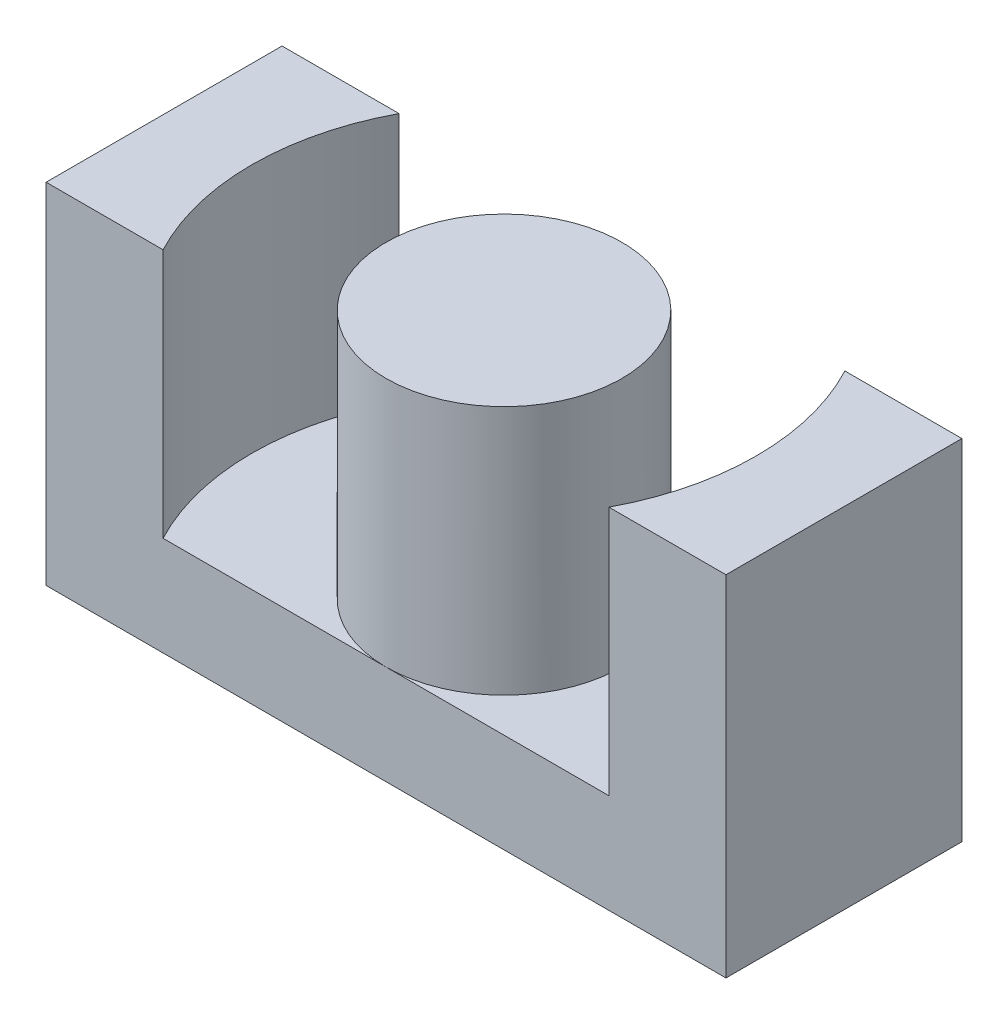
ISO-10303-21;
HEADER;
FILE_DESCRIPTION(('STEP AP214'),'2;1');
FILE_NAME('part.step','',(''),(''),'','','');
FILE_SCHEMA(('AUTOMOTIVE_DESIGN { 1 0 10303 214 1 1 1 1 }'));
ENDSEC;
DATA;
#1=APPLICATION_CONTEXT('core data for automotive mechanical design processes');
#2=APPLICATION_PROTOCOL_DEFINITION('international standard','automotive_design',2000,#1);
#3=PRODUCT_CONTEXT('',#1,'mechanical');
#4=PRODUCT('Part','Part','',(#3));
#5=PRODUCT_RELATED_PRODUCT_CATEGORY('part','',(#4));
#6=PRODUCT_DEFINITION_FORMATION('','',#4);
#7=PRODUCT_DEFINITION_CONTEXT('part definition',#1,'design');
#8=PRODUCT_DEFINITION('design','',#6,#7);
#9=PRODUCT_DEFINITION_SHAPE('','',#8);
#10=(LENGTH_UNIT() NAMED_UNIT(*) SI_UNIT(.MILLI.,.METRE.));
#11=(NAMED_UNIT(*) PLANE_ANGLE_UNIT() SI_UNIT($,.RADIAN.));
#12=(NAMED_UNIT(*) SI_UNIT($,.STERADIAN.) SOLID_ANGLE_UNIT());
#13=UNCERTAINTY_MEASURE_WITH_UNIT(LENGTH_MEASURE(1.E-05),#10,'distance_accuracy_value','');
#14=(GEOMETRIC_REPRESENTATION_CONTEXT(3) GLOBAL_UNCERTAINTY_ASSIGNED_CONTEXT((#13)) GLOBAL_UNIT_ASSIGNED_CONTEXT((#10,
#11,#12)) REPRESENTATION_CONTEXT('',''));
#15=CARTESIAN_POINT('',(0.,0.,0.));
#16=DIRECTION('',(0.,0.,1.));
#17=DIRECTION('',(1.,0.,0.));
#18=AXIS2_PLACEMENT_3D('',#15,#16,#17);
#19=CARTESIAN_POINT('',(0.,0.,22.4));
#20=DIRECTION('',(0.,1.,0.));
#21=DIRECTION('',(0.,0.,1.));
#22=AXIS2_PLACEMENT_3D('',#19,#20,#21);
#23=PLANE('',#22);
#24=CARTESIAN_POINT('',(0.,0.,22.4));
#25=DIRECTION('',(0.,1.,0.));
#26=DIRECTION('',(0.,0.,1.));
#27=AXIS2_PLACEMENT_3D('',#24,#25,#26);
#28=CIRCLE('',#27,7.6);
#29=CARTESIAN_POINT('',(0.,0.,30.));
#30=VERTEX_POINT('',#29);
#31=EDGE_CURVE('E20',#30,#30,#28,.F.);
#32=ORIENTED_EDGE('',*,*,#31,.F.);
#33=EDGE_LOOP('',(#32));
#34=FACE_BOUND('',#33,.T.);
#35=ADVANCED_FACE('F17',(#34),#23,.T.);
#36=CARTESIAN_POINT('',(0.,-0.1,22.4));
#37=DIRECTION('',(0.,1.,0.));
#38=DIRECTION('',(0.,0.,1.));
#39=AXIS2_PLACEMENT_3D('',#36,#37,#38);
#40=CYLINDRICAL_SURFACE('',#39,7.6);
#41=ORIENTED_EDGE('',*,*,#31,.T.);
#42=EDGE_LOOP('',(#41));
#43=FACE_BOUND('',#42,.T.);
#44=CARTESIAN_POINT('',(0.,-16.1,22.4));
#45=DIRECTION('',(0.,1.,0.));
#46=DIRECTION('',(0.,0.,1.));
#47=AXIS2_PLACEMENT_3D('',#44,#45,#46);
#48=CIRCLE('',#47,7.6);
#49=CARTESIAN_POINT('',(0.,-16.1,30.));
#50=VERTEX_POINT('',#49);
#51=CARTESIAN_POINT('',(0.,-16.1,14.8));
#52=VERTEX_POINT('',#51);
#53=EDGE_CURVE('E167',#50,#52,#48,.T.);
#54=ORIENTED_EDGE('',*,*,#53,.T.);
#55=CARTESIAN_POINT('',(0.,-16.1,22.4));
#56=DIRECTION('',(0.,1.,0.));
#57=DIRECTION('',(0.,0.,1.));
#58=AXIS2_PLACEMENT_3D('',#55,#56,#57);
#59=CIRCLE('',#58,7.6);
#60=EDGE_CURVE('E106',#52,#50,#59,.T.);
#61=ORIENTED_EDGE('',*,*,#60,.T.);
#62=EDGE_LOOP('',(#54,#61));
#63=FACE_BOUND('',#62,.T.);
#64=ADVANCED_FACE('F173',(#43,#63),#40,.T.);
#65=CARTESIAN_POINT('',(0.,0.,22.4));
#66=DIRECTION('',(0.,1.,0.));
#67=DIRECTION('',(0.,0.,1.));
#68=AXIS2_PLACEMENT_3D('',#65,#66,#67);
#69=PLANE('',#68);
#70=CARTESIAN_POINT('',(0.,0.,22.4));
#71=DIRECTION('',(0.,1.,0.));
#72=DIRECTION('',(0.,0.,1.));
#73=AXIS2_PLACEMENT_3D('',#70,#71,#72);
#74=CIRCLE('',#73,16.25);
#75=CARTESIAN_POINT('',(-14.3632343154309,0.,30.));
#76=VERTEX_POINT('',#75);
#77=CARTESIAN_POINT('',(-14.3632343154309,0.,14.8));
#78=VERTEX_POINT('',#77);
#79=EDGE_CURVE('E89',#76,#78,#74,.F.);
#80=ORIENTED_EDGE('',*,*,#79,.T.);
#81=DIRECTION('',(1.,0.,0.));
#82=VECTOR('',#81,1.);
#83=CARTESIAN_POINT('',(-21.9,0.,14.8));
#84=LINE('',#83,#82);
#85=CARTESIAN_POINT('',(-21.9,0.,14.8));
#86=VERTEX_POINT('',#85);
#87=EDGE_CURVE('E147',#78,#86,#84,.F.);
#88=ORIENTED_EDGE('',*,*,#87,.T.);
#89=DIRECTION('',(0.,0.,-1.));
#90=VECTOR('',#89,1.);
#91=CARTESIAN_POINT('',(-21.9,0.,30.));
#92=LINE('',#91,#90);
#93=CARTESIAN_POINT('',(-21.9,0.,30.));
#94=VERTEX_POINT('',#93);
#95=EDGE_CURVE('E92',#86,#94,#92,.F.);
#96=ORIENTED_EDGE('',*,*,#95,.T.);
#97=DIRECTION('',(1.,0.,0.));
#98=VECTOR('',#97,1.);
#99=CARTESIAN_POINT('',(-21.9,0.,30.));
#100=LINE('',#99,#98);
#101=EDGE_CURVE('E86',#94,#76,#100,.T.);
#102=ORIENTED_EDGE('',*,*,#101,.T.);
#103=EDGE_LOOP('',(#80,#88,#96,#102));
#104=FACE_BOUND('',#103,.T.);
#105=ADVANCED_FACE('F88',(#104),#69,.T.);
#106=CARTESIAN_POINT('',(0.,0.,22.4));
#107=DIRECTION('',(0.,1.,0.));
#108=DIRECTION('',(0.,0.,1.));
#109=AXIS2_PLACEMENT_3D('',#106,#107,#108);
#110=CYLINDRICAL_SURFACE('',#109,16.25);
#111=ORIENTED_EDGE('',*,*,#79,.F.);
#112=DIRECTION('',(0.,1.,0.));
#113=VECTOR('',#112,1.);
#114=CARTESIAN_POINT('',(-14.36323431543,-16.1,30.));
#115=LINE('',#114,#113);
#116=CARTESIAN_POINT('',(-14.3632343154309,-16.1,30.));
#117=VERTEX_POINT('',#116);
#118=EDGE_CURVE('E97',#76,#117,#115,.F.);
#119=ORIENTED_EDGE('',*,*,#118,.T.);
#120=CARTESIAN_POINT('',(0.,-16.1,22.4));
#121=DIRECTION('',(0.,1.,0.));
#122=DIRECTION('',(0.,0.,1.));
#123=AXIS2_PLACEMENT_3D('',#120,#121,#122);
#124=CIRCLE('',#123,16.25);
#125=CARTESIAN_POINT('',(-14.3632343154309,-16.1,14.8));
#126=VERTEX_POINT('',#125);
#127=EDGE_CURVE('E169',#117,#126,#124,.F.);
#128=ORIENTED_EDGE('',*,*,#127,.T.);
#129=DIRECTION('',(0.,-1.,0.));
#130=VECTOR('',#129,1.);
#131=CARTESIAN_POINT('',(-14.36323431543,-16.1,14.8));
#132=LINE('',#131,#130);
#133=EDGE_CURVE('E104',#126,#78,#132,.F.);
#134=ORIENTED_EDGE('',*,*,#133,.T.);
#135=EDGE_LOOP('',(#111,#119,#128,#134));
#136=FACE_BOUND('',#135,.T.);
#137=ADVANCED_FACE('F101',(#136),#110,.F.);
#138=CARTESIAN_POINT('',(21.9,-16.1,14.8));
#139=DIRECTION('',(0.,-1.,0.));
#140=DIRECTION('',(0.,0.,-1.));
#141=AXIS2_PLACEMENT_3D('',#138,#139,#140);
#142=PLANE('',#141);
#143=ORIENTED_EDGE('',*,*,#127,.F.);
#144=DIRECTION('',(1.,0.,0.));
#145=VECTOR('',#144,1.);
#146=CARTESIAN_POINT('',(-21.9,-16.1,30.));
#147=LINE('',#146,#145);
#148=EDGE_CURVE('E112',#117,#50,#147,.T.);
#149=ORIENTED_EDGE('',*,*,#148,.T.);
#150=ORIENTED_EDGE('',*,*,#60,.F.);
#151=DIRECTION('',(1.,0.,0.));
#152=VECTOR('',#151,1.);
#153=CARTESIAN_POINT('',(-21.9,-16.1,14.8));
#154=LINE('',#153,#152);
#155=EDGE_CURVE('E148',#52,#126,#154,.F.);
#156=ORIENTED_EDGE('',*,*,#155,.T.);
#157=EDGE_LOOP('',(#143,#149,#150,#156));
#158=FACE_BOUND('',#157,.T.);
#159=ADVANCED_FACE('F177',(#158),#142,.F.);
#160=CARTESIAN_POINT('',(21.9,-16.1,14.8));
#161=DIRECTION('',(0.,-1.,0.));
#162=DIRECTION('',(0.,0.,-1.));
#163=AXIS2_PLACEMENT_3D('',#160,#161,#162);
#164=PLANE('',#163);
#165=CARTESIAN_POINT('',(0.,-16.1,22.4));
#166=DIRECTION('',(0.,1.,0.));
#167=DIRECTION('',(0.,0.,1.));
#168=AXIS2_PLACEMENT_3D('',#165,#166,#167);
#169=CIRCLE('',#168,16.25);
#170=CARTESIAN_POINT('',(14.3632343154319,-16.1,30.));
#171=VERTEX_POINT('',#170);
#172=CARTESIAN_POINT('',(14.3632343154319,-16.1,14.8));
#173=VERTEX_POINT('',#172);
#174=EDGE_CURVE('E165',#171,#173,#169,.T.);
#175=ORIENTED_EDGE('',*,*,#174,.T.);
#176=DIRECTION('',(1.,0.,0.));
#177=VECTOR('',#176,1.);
#178=CARTESIAN_POINT('',(-21.9,-16.1,14.8));
#179=LINE('',#178,#177);
#180=EDGE_CURVE('E158',#173,#52,#179,.F.);
#181=ORIENTED_EDGE('',*,*,#180,.T.);
#182=ORIENTED_EDGE('',*,*,#53,.F.);
#183=DIRECTION('',(1.,0.,0.));
#184=VECTOR('',#183,1.);
#185=CARTESIAN_POINT('',(-21.9,-16.1,30.));
#186=LINE('',#185,#184);
#187=EDGE_CURVE('E114',#50,#171,#186,.T.);
#188=ORIENTED_EDGE('',*,*,#187,.T.);
#189=EDGE_LOOP('',(#175,#181,#182,#188));
#190=FACE_BOUND('',#189,.T.);
#191=ADVANCED_FACE('F179',(#190),#164,.F.);
#192=CARTESIAN_POINT('',(0.,0.,22.4));
#193=DIRECTION('',(0.,1.,0.));
#194=DIRECTION('',(0.,0.,1.));
#195=AXIS2_PLACEMENT_3D('',#192,#193,#194);
#196=CYLINDRICAL_SURFACE('',#195,16.25);
#197=CARTESIAN_POINT('',(0.,0.,22.4));
#198=DIRECTION('',(0.,1.,0.));
#199=DIRECTION('',(0.,0.,1.));
#200=AXIS2_PLACEMENT_3D('',#197,#198,#199);
#201=CIRCLE('',#200,16.25);
#202=CARTESIAN_POINT('',(14.3632343154319,0.,14.8));
#203=VERTEX_POINT('',#202);
#204=CARTESIAN_POINT('',(14.3632343154319,0.,30.));
#205=VERTEX_POINT('',#204);
#206=EDGE_CURVE('E126',#203,#205,#201,.F.);
#207=ORIENTED_EDGE('',*,*,#206,.F.);
#208=DIRECTION('',(0.,-1.,0.));
#209=VECTOR('',#208,1.);
#210=CARTESIAN_POINT('',(14.363234315432,-16.1,14.8));
#211=LINE('',#210,#209);
#212=EDGE_CURVE('E139',#203,#173,#211,.T.);
#213=ORIENTED_EDGE('',*,*,#212,.T.);
#214=ORIENTED_EDGE('',*,*,#174,.F.);
#215=DIRECTION('',(0.,1.,0.));
#216=VECTOR('',#215,1.);
#217=CARTESIAN_POINT('',(14.363234315432,-16.1,30.));
#218=LINE('',#217,#216);
#219=EDGE_CURVE('E183',#171,#205,#218,.T.);
#220=ORIENTED_EDGE('',*,*,#219,.T.);
#221=EDGE_LOOP('',(#207,#213,#214,#220));
#222=FACE_BOUND('',#221,.T.);
#223=ADVANCED_FACE('F221',(#222),#196,.F.);
#224=CARTESIAN_POINT('',(0.,0.,22.4));
#225=DIRECTION('',(0.,1.,0.));
#226=DIRECTION('',(0.,0.,1.));
#227=AXIS2_PLACEMENT_3D('',#224,#225,#226);
#228=PLANE('',#227);
#229=ORIENTED_EDGE('',*,*,#206,.T.);
#230=DIRECTION('',(1.,0.,0.));
#231=VECTOR('',#230,1.);
#232=CARTESIAN_POINT('',(-21.9,0.,30.));
#233=LINE('',#232,#231);
#234=CARTESIAN_POINT('',(21.9,0.,30.));
#235=VERTEX_POINT('',#234);
#236=EDGE_CURVE('E184',#205,#235,#233,.T.);
#237=ORIENTED_EDGE('',*,*,#236,.T.);
#238=DIRECTION('',(0.,0.,1.));
#239=VECTOR('',#238,1.);
#240=CARTESIAN_POINT('',(21.9,0.,30.));
#241=LINE('',#240,#239);
#242=CARTESIAN_POINT('',(21.9,0.,14.8));
#243=VERTEX_POINT('',#242);
#244=EDGE_CURVE('E143',#235,#243,#241,.F.);
#245=ORIENTED_EDGE('',*,*,#244,.T.);
#246=DIRECTION('',(1.,0.,0.));
#247=VECTOR('',#246,1.);
#248=CARTESIAN_POINT('',(-21.9,0.,14.8));
#249=LINE('',#248,#247);
#250=EDGE_CURVE('E125',#243,#203,#249,.F.);
#251=ORIENTED_EDGE('',*,*,#250,.T.);
#252=EDGE_LOOP('',(#229,#237,#245,#251));
#253=FACE_BOUND('',#252,.T.);
#254=ADVANCED_FACE('F210',(#253),#228,.T.);
#255=CARTESIAN_POINT('',(-21.9,-16.1,30.));
#256=DIRECTION('',(1.,0.,0.));
#257=DIRECTION('',(0.,0.,-1.));
#258=AXIS2_PLACEMENT_3D('',#255,#256,#257);
#259=PLANE('',#258);
#260=ORIENTED_EDGE('',*,*,#95,.F.);
#261=DIRECTION('',(0.,-1.,0.));
#262=VECTOR('',#261,1.);
#263=CARTESIAN_POINT('',(-21.9,-16.1,14.8));
#264=LINE('',#263,#262);
#265=CARTESIAN_POINT('',(-21.9,-22.5,14.8));
#266=VERTEX_POINT('',#265);
#267=EDGE_CURVE('E150',#86,#266,#264,.T.);
#268=ORIENTED_EDGE('',*,*,#267,.T.);
#269=DIRECTION('',(0.,0.,-1.));
#270=VECTOR('',#269,1.);
#271=CARTESIAN_POINT('',(-21.9,-22.5,14.8));
#272=LINE('',#271,#270);
#273=CARTESIAN_POINT('',(-21.9,-22.5,30.));
#274=VERTEX_POINT('',#273);
#275=EDGE_CURVE('E129',#274,#266,#272,.T.);
#276=ORIENTED_EDGE('',*,*,#275,.F.);
#277=DIRECTION('',(0.,1.,0.));
#278=VECTOR('',#277,1.);
#279=CARTESIAN_POINT('',(-21.9,-16.1,30.));
#280=LINE('',#279,#278);
#281=EDGE_CURVE('E98',#274,#94,#280,.T.);
#282=ORIENTED_EDGE('',*,*,#281,.T.);
#283=EDGE_LOOP('',(#260,#268,#276,#282));
#284=FACE_BOUND('',#283,.T.);
#285=ADVANCED_FACE('F212',(#284),#259,.F.);
#286=CARTESIAN_POINT('',(-21.9,-16.1,14.8));
#287=DIRECTION('',(0.,0.,1.));
#288=DIRECTION('',(0.,-1.,0.));
#289=AXIS2_PLACEMENT_3D('',#286,#287,#288);
#290=PLANE('',#289);
#291=ORIENTED_EDGE('',*,*,#87,.F.);
#292=ORIENTED_EDGE('',*,*,#133,.F.);
#293=ORIENTED_EDGE('',*,*,#155,.F.);
#294=ORIENTED_EDGE('',*,*,#180,.F.);
#295=ORIENTED_EDGE('',*,*,#212,.F.);
#296=ORIENTED_EDGE('',*,*,#250,.F.);
#297=DIRECTION('',(0.,1.,0.));
#298=VECTOR('',#297,1.);
#299=CARTESIAN_POINT('',(21.9,-16.1,14.8));
#300=LINE('',#299,#298);
#301=CARTESIAN_POINT('',(21.9,-22.5,14.8));
#302=VERTEX_POINT('',#301);
#303=EDGE_CURVE('E121',#243,#302,#300,.F.);
#304=ORIENTED_EDGE('',*,*,#303,.T.);
#305=DIRECTION('',(1.,0.,0.));
#306=VECTOR('',#305,1.);
#307=CARTESIAN_POINT('',(21.9,-22.5,14.8));
#308=LINE('',#307,#306);
#309=EDGE_CURVE('E132',#266,#302,#308,.T.);
#310=ORIENTED_EDGE('',*,*,#309,.F.);
#311=ORIENTED_EDGE('',*,*,#267,.F.);
#312=EDGE_LOOP('',(#291,#292,#293,#294,#295,#296,#304,#310,#311));
#313=FACE_BOUND('',#312,.T.);
#314=ADVANCED_FACE('F206',(#313),#290,.F.);
#315=CARTESIAN_POINT('',(21.9,-16.1,30.));
#316=DIRECTION('',(-1.,0.,0.));
#317=DIRECTION('',(0.,0.,1.));
#318=AXIS2_PLACEMENT_3D('',#315,#316,#317);
#319=PLANE('',#318);
#320=ORIENTED_EDGE('',*,*,#244,.F.);
#321=DIRECTION('',(0.,1.,0.));
#322=VECTOR('',#321,1.);
#323=CARTESIAN_POINT('',(21.9,-16.1,30.));
#324=LINE('',#323,#322);
#325=CARTESIAN_POINT('',(21.9,-22.5,30.));
#326=VERTEX_POINT('',#325);
#327=EDGE_CURVE('E35',#235,#326,#324,.F.);
#328=ORIENTED_EDGE('',*,*,#327,.T.);
#329=DIRECTION('',(0.,0.,-1.));
#330=VECTOR('',#329,1.);
#331=CARTESIAN_POINT('',(21.9,-22.5,14.8));
#332=LINE('',#331,#330);
#333=EDGE_CURVE('E26',#302,#326,#332,.F.);
#334=ORIENTED_EDGE('',*,*,#333,.F.);
#335=ORIENTED_EDGE('',*,*,#303,.F.);
#336=EDGE_LOOP('',(#320,#328,#334,#335));
#337=FACE_BOUND('',#336,.T.);
#338=ADVANCED_FACE('F203',(#337),#319,.F.);
#339=CARTESIAN_POINT('',(-21.9,-16.1,30.));
#340=DIRECTION('',(0.,0.,-1.));
#341=DIRECTION('',(0.,1.,0.));
#342=AXIS2_PLACEMENT_3D('',#339,#340,#341);
#343=PLANE('',#342);
#344=ORIENTED_EDGE('',*,*,#236,.F.);
#345=ORIENTED_EDGE('',*,*,#219,.F.);
#346=ORIENTED_EDGE('',*,*,#187,.F.);
#347=ORIENTED_EDGE('',*,*,#148,.F.);
#348=ORIENTED_EDGE('',*,*,#118,.F.);
#349=ORIENTED_EDGE('',*,*,#101,.F.);
#350=ORIENTED_EDGE('',*,*,#281,.F.);
#351=DIRECTION('',(1.,0.,0.));
#352=VECTOR('',#351,1.);
#353=CARTESIAN_POINT('',(21.9,-22.5,30.));
#354=LINE('',#353,#352);
#355=EDGE_CURVE('E11',#326,#274,#354,.F.);
#356=ORIENTED_EDGE('',*,*,#355,.F.);
#357=ORIENTED_EDGE('',*,*,#327,.F.);
#358=EDGE_LOOP('',(#344,#345,#346,#347,#348,#349,#350,#356,#357));
#359=FACE_BOUND('',#358,.T.);
#360=ADVANCED_FACE('F109',(#359),#343,.F.);
#361=CARTESIAN_POINT('',(21.9,-22.5,14.8));
#362=DIRECTION('',(0.,-1.,0.));
#363=DIRECTION('',(0.,0.,-1.));
#364=AXIS2_PLACEMENT_3D('',#361,#362,#363);
#365=PLANE('',#364);
#366=ORIENTED_EDGE('',*,*,#333,.T.);
#367=ORIENTED_EDGE('',*,*,#355,.T.);
#368=ORIENTED_EDGE('',*,*,#275,.T.);
#369=ORIENTED_EDGE('',*,*,#309,.T.);
#370=EDGE_LOOP('',(#366,#367,#368,#369));
#371=FACE_BOUND('',#370,.T.);
#372=ADVANCED_FACE('F200',(#371),#365,.T.);
#373=CLOSED_SHELL('',(#35,#64,#105,#137,#159,#191,#223,#254,#285,#314,#338,#360,#372));
#374=MANIFOLD_SOLID_BREP('B1',#373);
#375=ADVANCED_BREP_SHAPE_REPRESENTATION('',(#18,#374),#14);
#376=SHAPE_DEFINITION_REPRESENTATION(#9,#375);
ENDSEC;
END-ISO-10303-21;
